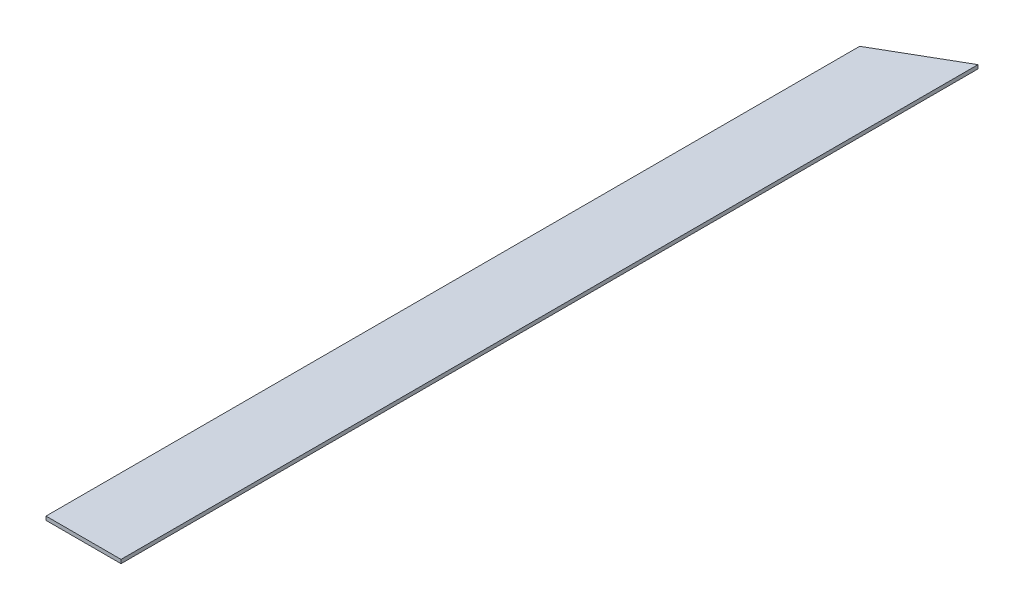
ISO-10303-21;
HEADER;
FILE_DESCRIPTION(('STEP AP214'),'2;1');
FILE_NAME('part.step','',(''),(''),'','','');
FILE_SCHEMA(('AUTOMOTIVE_DESIGN { 1 0 10303 214 1 1 1 1 }'));
ENDSEC;
DATA;
#1=APPLICATION_CONTEXT('core data for automotive mechanical design processes');
#2=APPLICATION_PROTOCOL_DEFINITION('international standard','automotive_design',2000,#1);
#3=PRODUCT_CONTEXT('',#1,'mechanical');
#4=PRODUCT('Part','Part','',(#3));
#5=PRODUCT_RELATED_PRODUCT_CATEGORY('part','',(#4));
#6=PRODUCT_DEFINITION_FORMATION('','',#4);
#7=PRODUCT_DEFINITION_CONTEXT('part definition',#1,'design');
#8=PRODUCT_DEFINITION('design','',#6,#7);
#9=PRODUCT_DEFINITION_SHAPE('','',#8);
#10=(LENGTH_UNIT() NAMED_UNIT(*) SI_UNIT(.MILLI.,.METRE.));
#11=(NAMED_UNIT(*) PLANE_ANGLE_UNIT() SI_UNIT($,.RADIAN.));
#12=(NAMED_UNIT(*) SI_UNIT($,.STERADIAN.) SOLID_ANGLE_UNIT());
#13=UNCERTAINTY_MEASURE_WITH_UNIT(LENGTH_MEASURE(1.E-05),#10,'distance_accuracy_value','');
#14=(GEOMETRIC_REPRESENTATION_CONTEXT(3) GLOBAL_UNCERTAINTY_ASSIGNED_CONTEXT((#13)) GLOBAL_UNIT_ASSIGNED_CONTEXT((#10,
#11,#12)) REPRESENTATION_CONTEXT('',''));
#15=CARTESIAN_POINT('',(0.,0.,0.));
#16=DIRECTION('',(0.,0.,1.));
#17=DIRECTION('',(1.,0.,0.));
#18=AXIS2_PLACEMENT_3D('',#15,#16,#17);
#19=CARTESIAN_POINT('',(-25.4000000000001,2.54,-550.830244955757));
#20=DIRECTION('',(1.,0.,0.));
#21=DIRECTION('',(0.,0.,-1.));
#22=AXIS2_PLACEMENT_3D('',#19,#20,#21);
#23=PLANE('',#22);
#24=DIRECTION('',(0.,0.,1.));
#25=VECTOR('',#24,1.);
#26=CARTESIAN_POINT('',(-25.4000000000001,0.,-550.830244955757));
#27=LINE('',#26,#25);
#28=CARTESIAN_POINT('',(-25.4000000000001,0.,-550.830244955757));
#29=VERTEX_POINT('',#28);
#30=CARTESIAN_POINT('',(-25.4,0.,0.));
#31=VERTEX_POINT('',#30);
#32=EDGE_CURVE('E99',#29,#31,#27,.T.);
#33=ORIENTED_EDGE('',*,*,#32,.T.);
#34=DIRECTION('',(0.,-1.,0.));
#35=VECTOR('',#34,1.);
#36=CARTESIAN_POINT('',(-25.4,2.54,0.));
#37=LINE('',#36,#35);
#38=CARTESIAN_POINT('',(-25.4,2.54,0.));
#39=VERTEX_POINT('',#38);
#40=EDGE_CURVE('E11',#39,#31,#37,.T.);
#41=ORIENTED_EDGE('',*,*,#40,.F.);
#42=DIRECTION('',(0.,0.,1.));
#43=VECTOR('',#42,1.);
#44=CARTESIAN_POINT('',(-25.4000000000001,2.54,-550.830244955757));
#45=LINE('',#44,#43);
#46=CARTESIAN_POINT('',(-25.4000000000001,2.54,-550.830244955757));
#47=VERTEX_POINT('',#46);
#48=EDGE_CURVE('E87',#47,#39,#45,.T.);
#49=ORIENTED_EDGE('',*,*,#48,.F.);
#50=DIRECTION('',(0.,-1.,0.));
#51=VECTOR('',#50,1.);
#52=CARTESIAN_POINT('',(-25.4000000000001,2.54,-550.830244955757));
#53=LINE('',#52,#51);
#54=EDGE_CURVE('E95',#47,#29,#53,.T.);
#55=ORIENTED_EDGE('',*,*,#54,.T.);
#56=EDGE_LOOP('',(#33,#41,#49,#55));
#57=FACE_BOUND('',#56,.T.);
#58=ADVANCED_FACE('F36',(#57),#23,.F.);
#59=CARTESIAN_POINT('',(-25.4,2.54,0.));
#60=DIRECTION('',(0.,0.,-1.));
#61=DIRECTION('',(-1.,0.,0.));
#62=AXIS2_PLACEMENT_3D('',#59,#60,#61);
#63=PLANE('',#62);
#64=DIRECTION('',(1.,0.,0.));
#65=VECTOR('',#64,1.);
#66=CARTESIAN_POINT('',(-25.4,0.,0.));
#67=LINE('',#66,#65);
#68=CARTESIAN_POINT('',(25.4,0.,0.));
#69=VERTEX_POINT('',#68);
#70=EDGE_CURVE('E91',#31,#69,#67,.T.);
#71=ORIENTED_EDGE('',*,*,#70,.T.);
#72=DIRECTION('',(0.,-1.,0.));
#73=VECTOR('',#72,1.);
#74=CARTESIAN_POINT('',(25.4,2.54,0.));
#75=LINE('',#74,#73);
#76=CARTESIAN_POINT('',(25.4,2.54,0.));
#77=VERTEX_POINT('',#76);
#78=EDGE_CURVE('E44',#77,#69,#75,.T.);
#79=ORIENTED_EDGE('',*,*,#78,.F.);
#80=DIRECTION('',(1.,0.,0.));
#81=VECTOR('',#80,1.);
#82=CARTESIAN_POINT('',(-25.4,2.54,0.));
#83=LINE('',#82,#81);
#84=EDGE_CURVE('E82',#39,#77,#83,.T.);
#85=ORIENTED_EDGE('',*,*,#84,.F.);
#86=ORIENTED_EDGE('',*,*,#40,.T.);
#87=EDGE_LOOP('',(#71,#79,#85,#86));
#88=FACE_BOUND('',#87,.T.);
#89=ADVANCED_FACE('F90',(#88),#63,.F.);
#90=CARTESIAN_POINT('',(25.4,2.54,0.));
#91=DIRECTION('',(-1.,0.,0.));
#92=DIRECTION('',(0.,0.,1.));
#93=AXIS2_PLACEMENT_3D('',#90,#91,#92);
#94=PLANE('',#93);
#95=DIRECTION('',(0.,0.,-1.));
#96=VECTOR('',#95,1.);
#97=CARTESIAN_POINT('',(25.4,0.,0.));
#98=LINE('',#97,#96);
#99=CARTESIAN_POINT('',(25.4,0.,-580.136));
#100=VERTEX_POINT('',#99);
#101=EDGE_CURVE('E69',#69,#100,#98,.T.);
#102=ORIENTED_EDGE('',*,*,#101,.T.);
#103=DIRECTION('',(0.,-1.,0.));
#104=VECTOR('',#103,1.);
#105=CARTESIAN_POINT('',(25.4,2.54,-580.136));
#106=LINE('',#105,#104);
#107=CARTESIAN_POINT('',(25.4,2.54,-580.136));
#108=VERTEX_POINT('',#107);
#109=EDGE_CURVE('E92',#108,#100,#106,.T.);
#110=ORIENTED_EDGE('',*,*,#109,.F.);
#111=DIRECTION('',(0.,0.,-1.));
#112=VECTOR('',#111,1.);
#113=CARTESIAN_POINT('',(25.4,2.54,0.));
#114=LINE('',#113,#112);
#115=EDGE_CURVE('E85',#77,#108,#114,.T.);
#116=ORIENTED_EDGE('',*,*,#115,.F.);
#117=ORIENTED_EDGE('',*,*,#78,.T.);
#118=EDGE_LOOP('',(#102,#110,#116,#117));
#119=FACE_BOUND('',#118,.T.);
#120=ADVANCED_FACE('F93',(#119),#94,.F.);
#121=CARTESIAN_POINT('',(25.4,2.54,-580.136));
#122=DIRECTION('',(0.499697669650357,0.,0.86619988394481));
#123=DIRECTION('',(0.86619988394481,0.,-0.499697669650357));
#124=AXIS2_PLACEMENT_3D('',#121,#122,#123);
#125=PLANE('',#124);
#126=DIRECTION('',(-0.86619988394481,0.,0.499697669650357));
#127=VECTOR('',#126,1.);
#128=CARTESIAN_POINT('',(25.4,0.,-580.136));
#129=LINE('',#128,#127);
#130=EDGE_CURVE('E75',#100,#29,#129,.T.);
#131=ORIENTED_EDGE('',*,*,#130,.T.);
#132=ORIENTED_EDGE('',*,*,#54,.F.);
#133=DIRECTION('',(-0.86619988394481,0.,0.499697669650357));
#134=VECTOR('',#133,1.);
#135=CARTESIAN_POINT('',(25.4,2.54,-580.136));
#136=LINE('',#135,#134);
#137=EDGE_CURVE('E52',#108,#47,#136,.T.);
#138=ORIENTED_EDGE('',*,*,#137,.F.);
#139=ORIENTED_EDGE('',*,*,#109,.T.);
#140=EDGE_LOOP('',(#131,#132,#138,#139));
#141=FACE_BOUND('',#140,.T.);
#142=ADVANCED_FACE('F106',(#141),#125,.F.);
#143=CARTESIAN_POINT('',(0.,2.54,0.));
#144=DIRECTION('',(0.,1.,0.));
#145=DIRECTION('',(0.,0.,1.));
#146=AXIS2_PLACEMENT_3D('',#143,#144,#145);
#147=PLANE('',#146);
#148=ORIENTED_EDGE('',*,*,#48,.T.);
#149=ORIENTED_EDGE('',*,*,#84,.T.);
#150=ORIENTED_EDGE('',*,*,#115,.T.);
#151=ORIENTED_EDGE('',*,*,#137,.T.);
#152=EDGE_LOOP('',(#148,#149,#150,#151));
#153=FACE_BOUND('',#152,.T.);
#154=ADVANCED_FACE('F83',(#153),#147,.T.);
#155=CARTESIAN_POINT('',(0.,0.,0.));
#156=DIRECTION('',(0.,1.,0.));
#157=DIRECTION('',(0.,0.,1.));
#158=AXIS2_PLACEMENT_3D('',#155,#156,#157);
#159=PLANE('',#158);
#160=ORIENTED_EDGE('',*,*,#32,.F.);
#161=ORIENTED_EDGE('',*,*,#130,.F.);
#162=ORIENTED_EDGE('',*,*,#101,.F.);
#163=ORIENTED_EDGE('',*,*,#70,.F.);
#164=EDGE_LOOP('',(#160,#161,#162,#163));
#165=FACE_BOUND('',#164,.T.);
#166=ADVANCED_FACE('F109',(#165),#159,.F.);
#167=CLOSED_SHELL('',(#58,#89,#120,#142,#154,#166));
#168=MANIFOLD_SOLID_BREP('B2',#167);
#169=ADVANCED_BREP_SHAPE_REPRESENTATION('',(#18,#168),#14);
#170=SHAPE_DEFINITION_REPRESENTATION(#9,#169);
ENDSEC;
END-ISO-10303-21;
